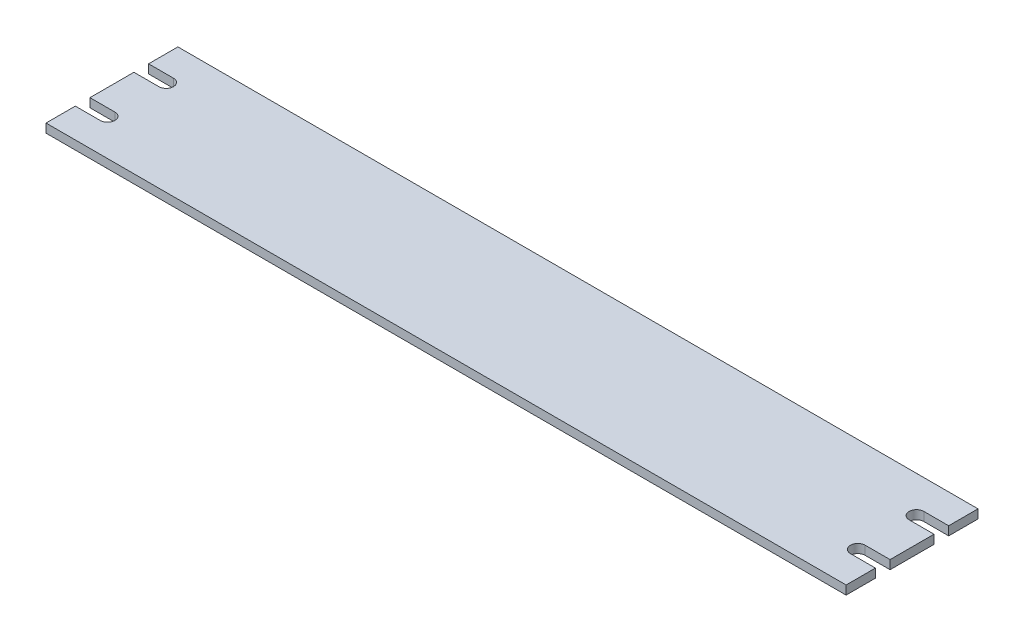
ISO-10303-21;
HEADER;
FILE_DESCRIPTION(('STEP AP214'),'2;1');
FILE_NAME('part.step','',(''),(''),'','','');
FILE_SCHEMA(('AUTOMOTIVE_DESIGN { 1 0 10303 214 1 1 1 1 }'));
ENDSEC;
DATA;
#1=APPLICATION_CONTEXT('core data for automotive mechanical design processes');
#2=APPLICATION_PROTOCOL_DEFINITION('international standard','automotive_design',2000,#1);
#3=PRODUCT_CONTEXT('',#1,'mechanical');
#4=PRODUCT('Part','Part','',(#3));
#5=PRODUCT_RELATED_PRODUCT_CATEGORY('part','',(#4));
#6=PRODUCT_DEFINITION_FORMATION('','',#4);
#7=PRODUCT_DEFINITION_CONTEXT('part definition',#1,'design');
#8=PRODUCT_DEFINITION('design','',#6,#7);
#9=PRODUCT_DEFINITION_SHAPE('','',#8);
#10=(LENGTH_UNIT() NAMED_UNIT(*) SI_UNIT(.MILLI.,.METRE.));
#11=(NAMED_UNIT(*) PLANE_ANGLE_UNIT() SI_UNIT($,.RADIAN.));
#12=(NAMED_UNIT(*) SI_UNIT($,.STERADIAN.) SOLID_ANGLE_UNIT());
#13=UNCERTAINTY_MEASURE_WITH_UNIT(LENGTH_MEASURE(1.E-05),#10,'distance_accuracy_value','');
#14=(GEOMETRIC_REPRESENTATION_CONTEXT(3) GLOBAL_UNCERTAINTY_ASSIGNED_CONTEXT((#13)) GLOBAL_UNIT_ASSIGNED_CONTEXT((#10,
#11,#12)) REPRESENTATION_CONTEXT('',''));
#15=CARTESIAN_POINT('',(0.,0.,0.));
#16=DIRECTION('',(0.,0.,1.));
#17=DIRECTION('',(1.,0.,0.));
#18=AXIS2_PLACEMENT_3D('',#15,#16,#17);
#19=CARTESIAN_POINT('',(136.5,3.,22.5));
#20=DIRECTION('',(-1.,0.,0.));
#21=DIRECTION('',(0.,0.,1.));
#22=AXIS2_PLACEMENT_3D('',#19,#20,#21);
#23=PLANE('',#22);
#24=DIRECTION('',(0.,0.,-1.));
#25=VECTOR('',#24,1.);
#26=CARTESIAN_POINT('',(136.5,0.,22.5));
#27=LINE('',#26,#25);
#28=CARTESIAN_POINT('',(136.5,0.,22.5));
#29=VERTEX_POINT('',#28);
#30=CARTESIAN_POINT('',(136.5,0.,12.5));
#31=VERTEX_POINT('',#30);
#32=EDGE_CURVE('E193',#29,#31,#27,.T.);
#33=ORIENTED_EDGE('',*,*,#32,.T.);
#34=DIRECTION('',(0.,1.,0.));
#35=VECTOR('',#34,1.);
#36=CARTESIAN_POINT('',(136.5,0.,12.5));
#37=LINE('',#36,#35);
#38=CARTESIAN_POINT('',(136.5,3.,12.5));
#39=VERTEX_POINT('',#38);
#40=EDGE_CURVE('E234',#31,#39,#37,.T.);
#41=ORIENTED_EDGE('',*,*,#40,.T.);
#42=DIRECTION('',(0.,0.,-1.));
#43=VECTOR('',#42,1.);
#44=CARTESIAN_POINT('',(136.5,3.,22.5));
#45=LINE('',#44,#43);
#46=CARTESIAN_POINT('',(136.5,3.,22.5));
#47=VERTEX_POINT('',#46);
#48=EDGE_CURVE('E217',#47,#39,#45,.T.);
#49=ORIENTED_EDGE('',*,*,#48,.F.);
#50=DIRECTION('',(0.,-1.,0.));
#51=VECTOR('',#50,1.);
#52=CARTESIAN_POINT('',(136.5,3.,22.5));
#53=LINE('',#52,#51);
#54=EDGE_CURVE('E41',#47,#29,#53,.T.);
#55=ORIENTED_EDGE('',*,*,#54,.T.);
#56=EDGE_LOOP('',(#33,#41,#49,#55));
#57=FACE_BOUND('',#56,.T.);
#58=ADVANCED_FACE('F33',(#57),#23,.F.);
#59=CARTESIAN_POINT('',(136.5,3.,7.50000000000006));
#60=VERTEX_POINT('',#59);
#61=CARTESIAN_POINT('',(136.5,3.,-7.50000000000009));
#62=VERTEX_POINT('',#61);
#63=EDGE_CURVE('E186',#60,#62,#45,.T.);
#64=ORIENTED_EDGE('',*,*,#63,.F.);
#65=DIRECTION('',(0.,1.,0.));
#66=VECTOR('',#65,1.);
#67=CARTESIAN_POINT('',(136.5,0.,7.50000000000006));
#68=LINE('',#67,#66);
#69=CARTESIAN_POINT('',(136.5,0.,7.50000000000006));
#70=VERTEX_POINT('',#69);
#71=EDGE_CURVE('E173',#70,#60,#68,.T.);
#72=ORIENTED_EDGE('',*,*,#71,.F.);
#73=CARTESIAN_POINT('',(136.5,0.,-7.50000000000009));
#74=VERTEX_POINT('',#73);
#75=EDGE_CURVE('E184',#70,#74,#27,.T.);
#76=ORIENTED_EDGE('',*,*,#75,.T.);
#77=DIRECTION('',(0.,1.,0.));
#78=VECTOR('',#77,1.);
#79=CARTESIAN_POINT('',(136.5,0.,-7.50000000000009));
#80=LINE('',#79,#78);
#81=EDGE_CURVE('E254',#74,#62,#80,.T.);
#82=ORIENTED_EDGE('',*,*,#81,.T.);
#83=EDGE_LOOP('',(#64,#72,#76,#82));
#84=FACE_BOUND('',#83,.T.);
#85=ADVANCED_FACE('F182',(#84),#23,.F.);
#86=CARTESIAN_POINT('',(-136.5,3.,22.5));
#87=DIRECTION('',(1.,0.,0.));
#88=DIRECTION('',(0.,0.,-1.));
#89=AXIS2_PLACEMENT_3D('',#86,#87,#88);
#90=PLANE('',#89);
#91=DIRECTION('',(0.,0.,1.));
#92=VECTOR('',#91,1.);
#93=CARTESIAN_POINT('',(-136.5,0.,22.5));
#94=LINE('',#93,#92);
#95=CARTESIAN_POINT('',(-136.5,0.,-7.50000000000009));
#96=VERTEX_POINT('',#95);
#97=CARTESIAN_POINT('',(-136.5,0.,7.50000000000006));
#98=VERTEX_POINT('',#97);
#99=EDGE_CURVE('E324',#96,#98,#94,.T.);
#100=ORIENTED_EDGE('',*,*,#99,.T.);
#101=DIRECTION('',(0.,1.,0.));
#102=VECTOR('',#101,1.);
#103=CARTESIAN_POINT('',(-136.5,0.,7.50000000000006));
#104=LINE('',#103,#102);
#105=CARTESIAN_POINT('',(-136.5,3.,7.50000000000006));
#106=VERTEX_POINT('',#105);
#107=EDGE_CURVE('E279',#98,#106,#104,.T.);
#108=ORIENTED_EDGE('',*,*,#107,.T.);
#109=DIRECTION('',(0.,0.,1.));
#110=VECTOR('',#109,1.);
#111=CARTESIAN_POINT('',(-136.5,3.,22.5));
#112=LINE('',#111,#110);
#113=CARTESIAN_POINT('',(-136.5,3.,-7.50000000000009));
#114=VERTEX_POINT('',#113);
#115=EDGE_CURVE('E318',#114,#106,#112,.T.);
#116=ORIENTED_EDGE('',*,*,#115,.F.);
#117=DIRECTION('',(0.,1.,0.));
#118=VECTOR('',#117,1.);
#119=CARTESIAN_POINT('',(-136.5,0.,-7.50000000000009));
#120=LINE('',#119,#118);
#121=EDGE_CURVE('E298',#96,#114,#120,.T.);
#122=ORIENTED_EDGE('',*,*,#121,.F.);
#123=EDGE_LOOP('',(#100,#108,#116,#122));
#124=FACE_BOUND('',#123,.T.);
#125=ADVANCED_FACE('F346',(#124),#90,.F.);
#126=CARTESIAN_POINT('',(-136.5,0.,-22.5));
#127=VERTEX_POINT('',#126);
#128=CARTESIAN_POINT('',(-136.5,0.,-12.5000000000001));
#129=VERTEX_POINT('',#128);
#130=EDGE_CURVE('E322',#127,#129,#94,.T.);
#131=ORIENTED_EDGE('',*,*,#130,.T.);
#132=DIRECTION('',(0.,1.,0.));
#133=VECTOR('',#132,1.);
#134=CARTESIAN_POINT('',(-136.5,0.,-12.5000000000001));
#135=LINE('',#134,#133);
#136=CARTESIAN_POINT('',(-136.5,3.,-12.5000000000001));
#137=VERTEX_POINT('',#136);
#138=EDGE_CURVE('E305',#129,#137,#135,.T.);
#139=ORIENTED_EDGE('',*,*,#138,.T.);
#140=CARTESIAN_POINT('',(-136.5,3.,-22.5));
#141=VERTEX_POINT('',#140);
#142=EDGE_CURVE('E314',#141,#137,#112,.T.);
#143=ORIENTED_EDGE('',*,*,#142,.F.);
#144=DIRECTION('',(0.,-1.,0.));
#145=VECTOR('',#144,1.);
#146=CARTESIAN_POINT('',(-136.5,3.,-22.5));
#147=LINE('',#146,#145);
#148=EDGE_CURVE('E204',#141,#127,#147,.T.);
#149=ORIENTED_EDGE('',*,*,#148,.T.);
#150=EDGE_LOOP('',(#131,#139,#143,#149));
#151=FACE_BOUND('',#150,.T.);
#152=ADVANCED_FACE('F365',(#151),#90,.F.);
#153=CARTESIAN_POINT('',(-136.5,3.,12.5));
#154=VERTEX_POINT('',#153);
#155=CARTESIAN_POINT('',(-136.5,3.,22.5));
#156=VERTEX_POINT('',#155);
#157=EDGE_CURVE('E203',#154,#156,#112,.T.);
#158=ORIENTED_EDGE('',*,*,#157,.F.);
#159=DIRECTION('',(0.,1.,0.));
#160=VECTOR('',#159,1.);
#161=CARTESIAN_POINT('',(-136.5,0.,12.5));
#162=LINE('',#161,#160);
#163=CARTESIAN_POINT('',(-136.5,0.,12.5));
#164=VERTEX_POINT('',#163);
#165=EDGE_CURVE('E272',#164,#154,#162,.T.);
#166=ORIENTED_EDGE('',*,*,#165,.F.);
#167=CARTESIAN_POINT('',(-136.5,0.,22.5));
#168=VERTEX_POINT('',#167);
#169=EDGE_CURVE('E308',#164,#168,#94,.T.);
#170=ORIENTED_EDGE('',*,*,#169,.T.);
#171=DIRECTION('',(0.,-1.,0.));
#172=VECTOR('',#171,1.);
#173=CARTESIAN_POINT('',(-136.5,3.,22.5));
#174=LINE('',#173,#172);
#175=EDGE_CURVE('E11',#156,#168,#174,.T.);
#176=ORIENTED_EDGE('',*,*,#175,.F.);
#177=EDGE_LOOP('',(#158,#166,#170,#176));
#178=FACE_BOUND('',#177,.T.);
#179=ADVANCED_FACE('F35',(#178),#90,.F.);
#180=CARTESIAN_POINT('',(136.5,3.,22.5));
#181=DIRECTION('',(0.,0.,-1.));
#182=DIRECTION('',(-1.,0.,0.));
#183=AXIS2_PLACEMENT_3D('',#180,#181,#182);
#184=PLANE('',#183);
#185=DIRECTION('',(1.,0.,0.));
#186=VECTOR('',#185,1.);
#187=CARTESIAN_POINT('',(136.5,0.,22.5));
#188=LINE('',#187,#186);
#189=EDGE_CURVE('E198',#168,#29,#188,.T.);
#190=ORIENTED_EDGE('',*,*,#189,.T.);
#191=ORIENTED_EDGE('',*,*,#54,.F.);
#192=DIRECTION('',(1.,0.,0.));
#193=VECTOR('',#192,1.);
#194=CARTESIAN_POINT('',(136.5,3.,22.5));
#195=LINE('',#194,#193);
#196=EDGE_CURVE('E317',#156,#47,#195,.T.);
#197=ORIENTED_EDGE('',*,*,#196,.F.);
#198=ORIENTED_EDGE('',*,*,#175,.T.);
#199=EDGE_LOOP('',(#190,#191,#197,#198));
#200=FACE_BOUND('',#199,.T.);
#201=ADVANCED_FACE('F400',(#200),#184,.F.);
#202=CARTESIAN_POINT('',(136.5,3.,-12.5000000000001));
#203=VERTEX_POINT('',#202);
#204=CARTESIAN_POINT('',(136.5,3.,-22.5));
#205=VERTEX_POINT('',#204);
#206=EDGE_CURVE('E320',#203,#205,#45,.T.);
#207=ORIENTED_EDGE('',*,*,#206,.F.);
#208=DIRECTION('',(0.,1.,0.));
#209=VECTOR('',#208,1.);
#210=CARTESIAN_POINT('',(136.5,0.,-12.5000000000001));
#211=LINE('',#210,#209);
#212=CARTESIAN_POINT('',(136.5,0.,-12.5000000000001));
#213=VERTEX_POINT('',#212);
#214=EDGE_CURVE('E246',#213,#203,#211,.T.);
#215=ORIENTED_EDGE('',*,*,#214,.F.);
#216=CARTESIAN_POINT('',(136.5,0.,-22.5));
#217=VERTEX_POINT('',#216);
#218=EDGE_CURVE('E194',#213,#217,#27,.T.);
#219=ORIENTED_EDGE('',*,*,#218,.T.);
#220=DIRECTION('',(0.,-1.,0.));
#221=VECTOR('',#220,1.);
#222=CARTESIAN_POINT('',(136.5,3.,-22.5));
#223=LINE('',#222,#221);
#224=EDGE_CURVE('E207',#205,#217,#223,.T.);
#225=ORIENTED_EDGE('',*,*,#224,.F.);
#226=EDGE_LOOP('',(#207,#215,#219,#225));
#227=FACE_BOUND('',#226,.T.);
#228=ADVANCED_FACE('F376',(#227),#23,.F.);
#229=CARTESIAN_POINT('',(136.5,3.,-22.5));
#230=DIRECTION('',(0.,0.,1.));
#231=DIRECTION('',(1.,0.,0.));
#232=AXIS2_PLACEMENT_3D('',#229,#230,#231);
#233=PLANE('',#232);
#234=DIRECTION('',(-1.,0.,0.));
#235=VECTOR('',#234,1.);
#236=CARTESIAN_POINT('',(136.5,0.,-22.5));
#237=LINE('',#236,#235);
#238=EDGE_CURVE('E197',#217,#127,#237,.T.);
#239=ORIENTED_EDGE('',*,*,#238,.T.);
#240=ORIENTED_EDGE('',*,*,#148,.F.);
#241=DIRECTION('',(-1.,0.,0.));
#242=VECTOR('',#241,1.);
#243=CARTESIAN_POINT('',(136.5,3.,-22.5));
#244=LINE('',#243,#242);
#245=EDGE_CURVE('E208',#205,#141,#244,.T.);
#246=ORIENTED_EDGE('',*,*,#245,.F.);
#247=ORIENTED_EDGE('',*,*,#224,.T.);
#248=EDGE_LOOP('',(#239,#240,#246,#247));
#249=FACE_BOUND('',#248,.T.);
#250=ADVANCED_FACE('F372',(#249),#233,.F.);
#251=CARTESIAN_POINT('',(0.,3.,0.));
#252=DIRECTION('',(0.,1.,0.));
#253=DIRECTION('',(0.,0.,1.));
#254=AXIS2_PLACEMENT_3D('',#251,#252,#253);
#255=PLANE('',#254);
#256=DIRECTION('',(1.,0.,0.));
#257=VECTOR('',#256,1.);
#258=CARTESIAN_POINT('',(136.5,3.,12.5));
#259=LINE('',#258,#257);
#260=CARTESIAN_POINT('',(128.,3.,12.5));
#261=VERTEX_POINT('',#260);
#262=EDGE_CURVE('E178',#261,#39,#259,.T.);
#263=ORIENTED_EDGE('',*,*,#262,.F.);
#264=CARTESIAN_POINT('',(128.,3.,10.));
#265=DIRECTION('',(0.,1.,0.));
#266=DIRECTION('',(0.,0.,1.));
#267=AXIS2_PLACEMENT_3D('',#264,#265,#266);
#268=CIRCLE('',#267,2.49999999999997);
#269=CARTESIAN_POINT('',(128.,3.,7.50000000000006));
#270=VERTEX_POINT('',#269);
#271=EDGE_CURVE('E230',#270,#261,#268,.T.);
#272=ORIENTED_EDGE('',*,*,#271,.F.);
#273=DIRECTION('',(-1.,0.,0.));
#274=VECTOR('',#273,1.);
#275=CARTESIAN_POINT('',(136.5,3.,7.50000000000006));
#276=LINE('',#275,#274);
#277=EDGE_CURVE('E228',#60,#270,#276,.T.);
#278=ORIENTED_EDGE('',*,*,#277,.F.);
#279=ORIENTED_EDGE('',*,*,#63,.T.);
#280=DIRECTION('',(1.,0.,0.));
#281=VECTOR('',#280,1.);
#282=CARTESIAN_POINT('',(136.5,3.,-7.50000000000009));
#283=LINE('',#282,#281);
#284=CARTESIAN_POINT('',(128.,3.,-7.50000000000012));
#285=VERTEX_POINT('',#284);
#286=EDGE_CURVE('E243',#285,#62,#283,.T.);
#287=ORIENTED_EDGE('',*,*,#286,.F.);
#288=CARTESIAN_POINT('',(128.,3.,-10.0000000000001));
#289=DIRECTION('',(0.,1.,0.));
#290=DIRECTION('',(0.,0.,-1.));
#291=AXIS2_PLACEMENT_3D('',#288,#289,#290);
#292=CIRCLE('',#291,2.5);
#293=CARTESIAN_POINT('',(128.,3.,-12.5000000000001));
#294=VERTEX_POINT('',#293);
#295=EDGE_CURVE('E249',#294,#285,#292,.T.);
#296=ORIENTED_EDGE('',*,*,#295,.F.);
#297=DIRECTION('',(-1.,0.,0.));
#298=VECTOR('',#297,1.);
#299=CARTESIAN_POINT('',(136.5,3.,-12.5000000000001));
#300=LINE('',#299,#298);
#301=EDGE_CURVE('E236',#203,#294,#300,.T.);
#302=ORIENTED_EDGE('',*,*,#301,.F.);
#303=ORIENTED_EDGE('',*,*,#206,.T.);
#304=ORIENTED_EDGE('',*,*,#245,.T.);
#305=ORIENTED_EDGE('',*,*,#142,.T.);
#306=DIRECTION('',(-1.,0.,0.));
#307=VECTOR('',#306,1.);
#308=CARTESIAN_POINT('',(-136.5,3.,-12.5000000000001));
#309=LINE('',#308,#307);
#310=CARTESIAN_POINT('',(-128.,3.,-12.5000000000001));
#311=VERTEX_POINT('',#310);
#312=EDGE_CURVE('E292',#311,#137,#309,.T.);
#313=ORIENTED_EDGE('',*,*,#312,.F.);
#314=CARTESIAN_POINT('',(-128.,3.,-10.0000000000001));
#315=DIRECTION('',(0.,1.,0.));
#316=DIRECTION('',(0.,0.,1.));
#317=AXIS2_PLACEMENT_3D('',#314,#315,#316);
#318=CIRCLE('',#317,2.5);
#319=CARTESIAN_POINT('',(-128.,3.,-7.50000000000006));
#320=VERTEX_POINT('',#319);
#321=EDGE_CURVE('E301',#320,#311,#318,.T.);
#322=ORIENTED_EDGE('',*,*,#321,.F.);
#323=DIRECTION('',(1.,0.,0.));
#324=VECTOR('',#323,1.);
#325=CARTESIAN_POINT('',(-136.5,3.,-7.50000000000009));
#326=LINE('',#325,#324);
#327=EDGE_CURVE('E282',#114,#320,#326,.T.);
#328=ORIENTED_EDGE('',*,*,#327,.F.);
#329=ORIENTED_EDGE('',*,*,#115,.T.);
#330=DIRECTION('',(-1.,0.,0.));
#331=VECTOR('',#330,1.);
#332=CARTESIAN_POINT('',(-136.5,3.,7.50000000000006));
#333=LINE('',#332,#331);
#334=CARTESIAN_POINT('',(-128.,3.,7.50000000000006));
#335=VERTEX_POINT('',#334);
#336=EDGE_CURVE('E266',#335,#106,#333,.T.);
#337=ORIENTED_EDGE('',*,*,#336,.F.);
#338=CARTESIAN_POINT('',(-128.,3.,10.));
#339=DIRECTION('',(0.,1.,0.));
#340=DIRECTION('',(0.,0.,-1.));
#341=AXIS2_PLACEMENT_3D('',#338,#339,#340);
#342=CIRCLE('',#341,2.49999999999997);
#343=CARTESIAN_POINT('',(-128.,3.,12.5));
#344=VERTEX_POINT('',#343);
#345=EDGE_CURVE('E275',#344,#335,#342,.T.);
#346=ORIENTED_EDGE('',*,*,#345,.F.);
#347=DIRECTION('',(1.,0.,0.));
#348=VECTOR('',#347,1.);
#349=CARTESIAN_POINT('',(-136.5,3.,12.5));
#350=LINE('',#349,#348);
#351=EDGE_CURVE('E256',#154,#344,#350,.T.);
#352=ORIENTED_EDGE('',*,*,#351,.F.);
#353=ORIENTED_EDGE('',*,*,#157,.T.);
#354=ORIENTED_EDGE('',*,*,#196,.T.);
#355=ORIENTED_EDGE('',*,*,#48,.T.);
#356=EDGE_LOOP('',(#263,#272,#278,#279,#287,#296,#302,#303,#304,#305,#313,#322,#328,#329,#337,
#346,#352,#353,#354,#355));
#357=FACE_BOUND('',#356,.T.);
#358=ADVANCED_FACE('F356',(#357),#255,.T.);
#359=CARTESIAN_POINT('',(0.,0.,0.));
#360=DIRECTION('',(0.,1.,0.));
#361=DIRECTION('',(0.,0.,1.));
#362=AXIS2_PLACEMENT_3D('',#359,#360,#361);
#363=PLANE('',#362);
#364=CARTESIAN_POINT('',(128.,0.,10.));
#365=DIRECTION('',(0.,1.,0.));
#366=DIRECTION('',(0.,0.,1.));
#367=AXIS2_PLACEMENT_3D('',#364,#365,#366);
#368=CIRCLE('',#367,2.49999999999997);
#369=CARTESIAN_POINT('',(128.,0.,7.50000000000006));
#370=VERTEX_POINT('',#369);
#371=CARTESIAN_POINT('',(128.,0.,12.5));
#372=VERTEX_POINT('',#371);
#373=EDGE_CURVE('E48',#370,#372,#368,.T.);
#374=ORIENTED_EDGE('',*,*,#373,.T.);
#375=DIRECTION('',(1.,0.,0.));
#376=VECTOR('',#375,1.);
#377=CARTESIAN_POINT('',(136.5,0.,12.5));
#378=LINE('',#377,#376);
#379=EDGE_CURVE('E187',#372,#31,#378,.T.);
#380=ORIENTED_EDGE('',*,*,#379,.T.);
#381=ORIENTED_EDGE('',*,*,#32,.F.);
#382=ORIENTED_EDGE('',*,*,#189,.F.);
#383=ORIENTED_EDGE('',*,*,#169,.F.);
#384=DIRECTION('',(1.,0.,0.));
#385=VECTOR('',#384,1.);
#386=CARTESIAN_POINT('',(-136.5,0.,12.5));
#387=LINE('',#386,#385);
#388=CARTESIAN_POINT('',(-128.,0.,12.5));
#389=VERTEX_POINT('',#388);
#390=EDGE_CURVE('E262',#164,#389,#387,.T.);
#391=ORIENTED_EDGE('',*,*,#390,.T.);
#392=CARTESIAN_POINT('',(-128.,0.,10.));
#393=DIRECTION('',(0.,1.,0.));
#394=DIRECTION('',(0.,0.,-1.));
#395=AXIS2_PLACEMENT_3D('',#392,#393,#394);
#396=CIRCLE('',#395,2.49999999999997);
#397=CARTESIAN_POINT('',(-128.,0.,7.50000000000006));
#398=VERTEX_POINT('',#397);
#399=EDGE_CURVE('E265',#389,#398,#396,.T.);
#400=ORIENTED_EDGE('',*,*,#399,.T.);
#401=DIRECTION('',(-1.,0.,0.));
#402=VECTOR('',#401,1.);
#403=CARTESIAN_POINT('',(-136.5,0.,7.50000000000006));
#404=LINE('',#403,#402);
#405=EDGE_CURVE('E269',#398,#98,#404,.T.);
#406=ORIENTED_EDGE('',*,*,#405,.T.);
#407=ORIENTED_EDGE('',*,*,#99,.F.);
#408=DIRECTION('',(1.,0.,0.));
#409=VECTOR('',#408,1.);
#410=CARTESIAN_POINT('',(-136.5,0.,-7.50000000000009));
#411=LINE('',#410,#409);
#412=CARTESIAN_POINT('',(-128.,0.,-7.50000000000009));
#413=VERTEX_POINT('',#412);
#414=EDGE_CURVE('E288',#96,#413,#411,.T.);
#415=ORIENTED_EDGE('',*,*,#414,.T.);
#416=CARTESIAN_POINT('',(-128.,0.,-10.0000000000001));
#417=DIRECTION('',(0.,1.,0.));
#418=DIRECTION('',(0.,0.,1.));
#419=AXIS2_PLACEMENT_3D('',#416,#417,#418);
#420=CIRCLE('',#419,2.5);
#421=CARTESIAN_POINT('',(-128.,0.,-12.5000000000001));
#422=VERTEX_POINT('',#421);
#423=EDGE_CURVE('E291',#413,#422,#420,.T.);
#424=ORIENTED_EDGE('',*,*,#423,.T.);
#425=DIRECTION('',(-1.,0.,0.));
#426=VECTOR('',#425,1.);
#427=CARTESIAN_POINT('',(-136.5,0.,-12.5000000000001));
#428=LINE('',#427,#426);
#429=EDGE_CURVE('E295',#422,#129,#428,.T.);
#430=ORIENTED_EDGE('',*,*,#429,.T.);
#431=ORIENTED_EDGE('',*,*,#130,.F.);
#432=ORIENTED_EDGE('',*,*,#238,.F.);
#433=ORIENTED_EDGE('',*,*,#218,.F.);
#434=DIRECTION('',(-1.,0.,0.));
#435=VECTOR('',#434,1.);
#436=CARTESIAN_POINT('',(136.5,0.,-12.5000000000001));
#437=LINE('',#436,#435);
#438=CARTESIAN_POINT('',(128.,0.,-12.5000000000001));
#439=VERTEX_POINT('',#438);
#440=EDGE_CURVE('E240',#213,#439,#437,.T.);
#441=ORIENTED_EDGE('',*,*,#440,.T.);
#442=CARTESIAN_POINT('',(128.,0.,-10.0000000000001));
#443=DIRECTION('',(0.,1.,0.));
#444=DIRECTION('',(0.,0.,-1.));
#445=AXIS2_PLACEMENT_3D('',#442,#443,#444);
#446=CIRCLE('',#445,2.5);
#447=CARTESIAN_POINT('',(128.,0.,-7.50000000000012));
#448=VERTEX_POINT('',#447);
#449=EDGE_CURVE('E56',#439,#448,#446,.T.);
#450=ORIENTED_EDGE('',*,*,#449,.T.);
#451=DIRECTION('',(1.,0.,0.));
#452=VECTOR('',#451,1.);
#453=CARTESIAN_POINT('',(136.5,0.,-7.50000000000009));
#454=LINE('',#453,#452);
#455=EDGE_CURVE('E192',#448,#74,#454,.T.);
#456=ORIENTED_EDGE('',*,*,#455,.T.);
#457=ORIENTED_EDGE('',*,*,#75,.F.);
#458=DIRECTION('',(-1.,0.,0.));
#459=VECTOR('',#458,1.);
#460=CARTESIAN_POINT('',(136.5,0.,7.50000000000006));
#461=LINE('',#460,#459);
#462=EDGE_CURVE('E169',#70,#370,#461,.T.);
#463=ORIENTED_EDGE('',*,*,#462,.T.);
#464=EDGE_LOOP('',(#374,#380,#381,#382,#383,#391,#400,#406,#407,#415,#424,#430,#431,#432,#433,
#441,#450,#456,#457,#463));
#465=FACE_BOUND('',#464,.T.);
#466=ADVANCED_FACE('F190',(#465),#363,.F.);
#467=CARTESIAN_POINT('',(-136.5,0.,-12.5000000000001));
#468=DIRECTION('',(0.,0.,-1.));
#469=DIRECTION('',(-1.,0.,0.));
#470=AXIS2_PLACEMENT_3D('',#467,#468,#469);
#471=PLANE('',#470);
#472=ORIENTED_EDGE('',*,*,#312,.T.);
#473=ORIENTED_EDGE('',*,*,#138,.F.);
#474=ORIENTED_EDGE('',*,*,#429,.F.);
#475=DIRECTION('',(0.,1.,0.));
#476=VECTOR('',#475,1.);
#477=CARTESIAN_POINT('',(-128.,0.,-12.5000000000001));
#478=LINE('',#477,#476);
#479=EDGE_CURVE('E309',#422,#311,#478,.T.);
#480=ORIENTED_EDGE('',*,*,#479,.T.);
#481=EDGE_LOOP('',(#472,#473,#474,#480));
#482=FACE_BOUND('',#481,.T.);
#483=ADVANCED_FACE('F363',(#482),#471,.F.);
#484=CARTESIAN_POINT('',(-128.,0.,-10.0000000000001));
#485=DIRECTION('',(0.,1.,0.));
#486=DIRECTION('',(0.,0.,1.));
#487=AXIS2_PLACEMENT_3D('',#484,#485,#486);
#488=CYLINDRICAL_SURFACE('',#487,2.5);
#489=ORIENTED_EDGE('',*,*,#321,.T.);
#490=ORIENTED_EDGE('',*,*,#479,.F.);
#491=ORIENTED_EDGE('',*,*,#423,.F.);
#492=DIRECTION('',(0.,1.,0.));
#493=VECTOR('',#492,1.);
#494=CARTESIAN_POINT('',(-128.,0.,-7.50000000000006));
#495=LINE('',#494,#493);
#496=EDGE_CURVE('E311',#413,#320,#495,.T.);
#497=ORIENTED_EDGE('',*,*,#496,.T.);
#498=EDGE_LOOP('',(#489,#490,#491,#497));
#499=FACE_BOUND('',#498,.T.);
#500=ADVANCED_FACE('F359',(#499),#488,.F.);
#501=CARTESIAN_POINT('',(-136.5,0.,-7.50000000000009));
#502=DIRECTION('',(0.,0.,1.));
#503=DIRECTION('',(1.,0.,0.));
#504=AXIS2_PLACEMENT_3D('',#501,#502,#503);
#505=PLANE('',#504);
#506=ORIENTED_EDGE('',*,*,#327,.T.);
#507=ORIENTED_EDGE('',*,*,#496,.F.);
#508=ORIENTED_EDGE('',*,*,#414,.F.);
#509=ORIENTED_EDGE('',*,*,#121,.T.);
#510=EDGE_LOOP('',(#506,#507,#508,#509));
#511=FACE_BOUND('',#510,.T.);
#512=ADVANCED_FACE('F351',(#511),#505,.F.);
#513=CARTESIAN_POINT('',(-136.5,0.,7.50000000000006));
#514=DIRECTION('',(0.,0.,-1.));
#515=DIRECTION('',(-1.,0.,0.));
#516=AXIS2_PLACEMENT_3D('',#513,#514,#515);
#517=PLANE('',#516);
#518=ORIENTED_EDGE('',*,*,#336,.T.);
#519=ORIENTED_EDGE('',*,*,#107,.F.);
#520=ORIENTED_EDGE('',*,*,#405,.F.);
#521=DIRECTION('',(0.,1.,0.));
#522=VECTOR('',#521,1.);
#523=CARTESIAN_POINT('',(-128.,0.,7.50000000000006));
#524=LINE('',#523,#522);
#525=EDGE_CURVE('E283',#398,#335,#524,.T.);
#526=ORIENTED_EDGE('',*,*,#525,.T.);
#527=EDGE_LOOP('',(#518,#519,#520,#526));
#528=FACE_BOUND('',#527,.T.);
#529=ADVANCED_FACE('F342',(#528),#517,.F.);
#530=CARTESIAN_POINT('',(-128.,0.,10.));
#531=DIRECTION('',(0.,1.,0.));
#532=DIRECTION('',(0.,0.,1.));
#533=AXIS2_PLACEMENT_3D('',#530,#531,#532);
#534=CYLINDRICAL_SURFACE('',#533,2.49999999999997);
#535=ORIENTED_EDGE('',*,*,#345,.T.);
#536=ORIENTED_EDGE('',*,*,#525,.F.);
#537=ORIENTED_EDGE('',*,*,#399,.F.);
#538=DIRECTION('',(0.,1.,0.));
#539=VECTOR('',#538,1.);
#540=CARTESIAN_POINT('',(-128.,0.,12.5));
#541=LINE('',#540,#539);
#542=EDGE_CURVE('E285',#389,#344,#541,.T.);
#543=ORIENTED_EDGE('',*,*,#542,.T.);
#544=EDGE_LOOP('',(#535,#536,#537,#543));
#545=FACE_BOUND('',#544,.T.);
#546=ADVANCED_FACE('F338',(#545),#534,.F.);
#547=CARTESIAN_POINT('',(-136.5,0.,12.5));
#548=DIRECTION('',(0.,0.,1.));
#549=DIRECTION('',(1.,0.,0.));
#550=AXIS2_PLACEMENT_3D('',#547,#548,#549);
#551=PLANE('',#550);
#552=ORIENTED_EDGE('',*,*,#351,.T.);
#553=ORIENTED_EDGE('',*,*,#542,.F.);
#554=ORIENTED_EDGE('',*,*,#390,.F.);
#555=ORIENTED_EDGE('',*,*,#165,.T.);
#556=EDGE_LOOP('',(#552,#553,#554,#555));
#557=FACE_BOUND('',#556,.T.);
#558=ADVANCED_FACE('F334',(#557),#551,.F.);
#559=CARTESIAN_POINT('',(136.5,0.,-7.50000000000009));
#560=DIRECTION('',(0.,0.,1.));
#561=DIRECTION('',(1.,0.,0.));
#562=AXIS2_PLACEMENT_3D('',#559,#560,#561);
#563=PLANE('',#562);
#564=ORIENTED_EDGE('',*,*,#286,.T.);
#565=ORIENTED_EDGE('',*,*,#81,.F.);
#566=ORIENTED_EDGE('',*,*,#455,.F.);
#567=DIRECTION('',(0.,1.,0.));
#568=VECTOR('',#567,1.);
#569=CARTESIAN_POINT('',(128.,0.,-7.50000000000012));
#570=LINE('',#569,#568);
#571=EDGE_CURVE('E257',#448,#285,#570,.T.);
#572=ORIENTED_EDGE('',*,*,#571,.T.);
#573=EDGE_LOOP('',(#564,#565,#566,#572));
#574=FACE_BOUND('',#573,.T.);
#575=ADVANCED_FACE('F383',(#574),#563,.F.);
#576=CARTESIAN_POINT('',(128.,0.,-10.0000000000001));
#577=DIRECTION('',(0.,1.,0.));
#578=DIRECTION('',(0.,0.,1.));
#579=AXIS2_PLACEMENT_3D('',#576,#577,#578);
#580=CYLINDRICAL_SURFACE('',#579,2.5);
#581=ORIENTED_EDGE('',*,*,#295,.T.);
#582=ORIENTED_EDGE('',*,*,#571,.F.);
#583=ORIENTED_EDGE('',*,*,#449,.F.);
#584=DIRECTION('',(0.,1.,0.));
#585=VECTOR('',#584,1.);
#586=CARTESIAN_POINT('',(128.,0.,-12.5000000000001));
#587=LINE('',#586,#585);
#588=EDGE_CURVE('E259',#439,#294,#587,.T.);
#589=ORIENTED_EDGE('',*,*,#588,.T.);
#590=EDGE_LOOP('',(#581,#582,#583,#589));
#591=FACE_BOUND('',#590,.T.);
#592=ADVANCED_FACE('F381',(#591),#580,.F.);
#593=CARTESIAN_POINT('',(136.5,0.,-12.5000000000001));
#594=DIRECTION('',(0.,0.,-1.));
#595=DIRECTION('',(-1.,0.,0.));
#596=AXIS2_PLACEMENT_3D('',#593,#594,#595);
#597=PLANE('',#596);
#598=ORIENTED_EDGE('',*,*,#301,.T.);
#599=ORIENTED_EDGE('',*,*,#588,.F.);
#600=ORIENTED_EDGE('',*,*,#440,.F.);
#601=ORIENTED_EDGE('',*,*,#214,.T.);
#602=EDGE_LOOP('',(#598,#599,#600,#601));
#603=FACE_BOUND('',#602,.T.);
#604=ADVANCED_FACE('F378',(#603),#597,.F.);
#605=CARTESIAN_POINT('',(136.5,0.,12.5));
#606=DIRECTION('',(0.,0.,1.));
#607=DIRECTION('',(1.,0.,0.));
#608=AXIS2_PLACEMENT_3D('',#605,#606,#607);
#609=PLANE('',#608);
#610=ORIENTED_EDGE('',*,*,#262,.T.);
#611=ORIENTED_EDGE('',*,*,#40,.F.);
#612=ORIENTED_EDGE('',*,*,#379,.F.);
#613=DIRECTION('',(0.,1.,0.));
#614=VECTOR('',#613,1.);
#615=CARTESIAN_POINT('',(128.,0.,12.5));
#616=LINE('',#615,#614);
#617=EDGE_CURVE('E237',#372,#261,#616,.T.);
#618=ORIENTED_EDGE('',*,*,#617,.T.);
#619=EDGE_LOOP('',(#610,#611,#612,#618));
#620=FACE_BOUND('',#619,.T.);
#621=ADVANCED_FACE('F409',(#620),#609,.F.);
#622=CARTESIAN_POINT('',(128.,0.,10.));
#623=DIRECTION('',(0.,1.,0.));
#624=DIRECTION('',(0.,0.,1.));
#625=AXIS2_PLACEMENT_3D('',#622,#623,#624);
#626=CYLINDRICAL_SURFACE('',#625,2.49999999999997);
#627=ORIENTED_EDGE('',*,*,#271,.T.);
#628=ORIENTED_EDGE('',*,*,#617,.F.);
#629=ORIENTED_EDGE('',*,*,#373,.F.);
#630=DIRECTION('',(0.,1.,0.));
#631=VECTOR('',#630,1.);
#632=CARTESIAN_POINT('',(128.,0.,7.50000000000006));
#633=LINE('',#632,#631);
#634=EDGE_CURVE('E175',#370,#270,#633,.T.);
#635=ORIENTED_EDGE('',*,*,#634,.T.);
#636=EDGE_LOOP('',(#627,#628,#629,#635));
#637=FACE_BOUND('',#636,.T.);
#638=ADVANCED_FACE('F410',(#637),#626,.F.);
#639=CARTESIAN_POINT('',(136.5,0.,7.50000000000006));
#640=DIRECTION('',(0.,0.,-1.));
#641=DIRECTION('',(-1.,0.,0.));
#642=AXIS2_PLACEMENT_3D('',#639,#640,#641);
#643=PLANE('',#642);
#644=ORIENTED_EDGE('',*,*,#277,.T.);
#645=ORIENTED_EDGE('',*,*,#634,.F.);
#646=ORIENTED_EDGE('',*,*,#462,.F.);
#647=ORIENTED_EDGE('',*,*,#71,.T.);
#648=EDGE_LOOP('',(#644,#645,#646,#647));
#649=FACE_BOUND('',#648,.T.);
#650=ADVANCED_FACE('F172',(#649),#643,.F.);
#651=CLOSED_SHELL('',(#58,#85,#125,#152,#179,#201,#228,#250,#358,#466,#483,#500,#512,#529,#546,
#558,#575,#592,#604,#621,#638,#650));
#652=MANIFOLD_SOLID_BREP('B2',#651);
#653=ADVANCED_BREP_SHAPE_REPRESENTATION('',(#18,#652),#14);
#654=SHAPE_DEFINITION_REPRESENTATION(#9,#653);
ENDSEC;
END-ISO-10303-21;
